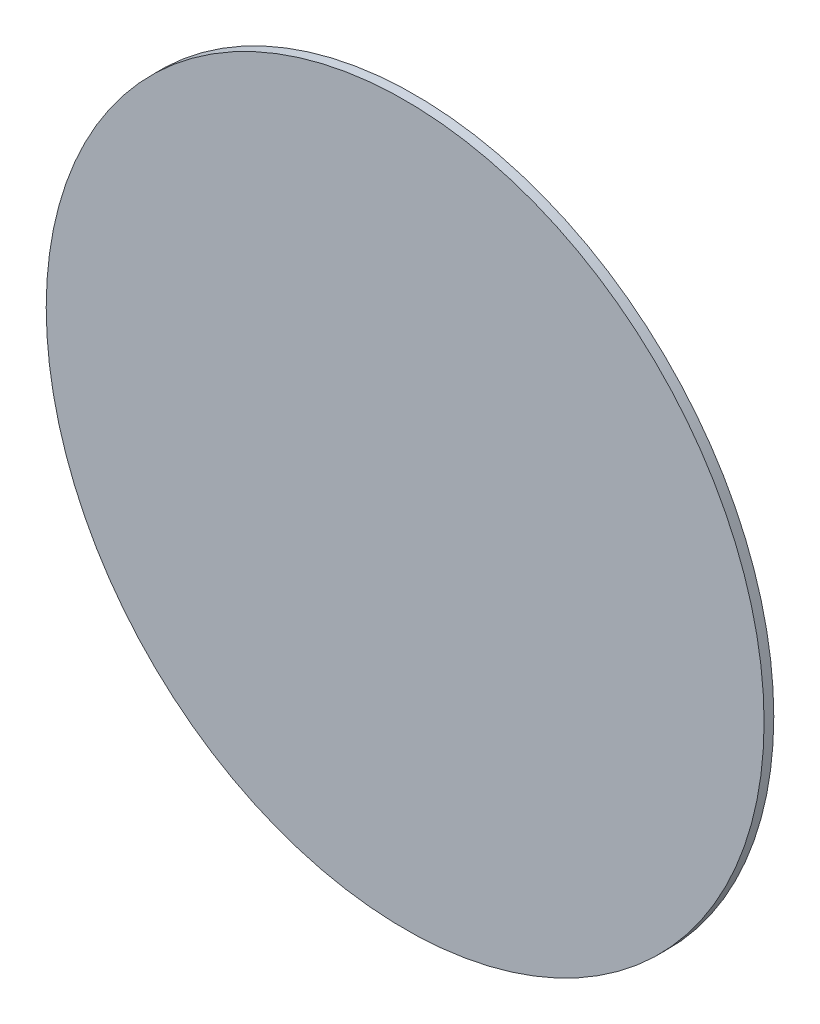
ISO-10303-21;
HEADER;
FILE_DESCRIPTION(('STEP AP214'),'2;1');
FILE_NAME('part.step','',(''),(''),'','','');
FILE_SCHEMA(('AUTOMOTIVE_DESIGN { 1 0 10303 214 1 1 1 1 }'));
ENDSEC;
DATA;
#1=APPLICATION_CONTEXT('core data for automotive mechanical design processes');
#2=APPLICATION_PROTOCOL_DEFINITION('international standard','automotive_design',2000,#1);
#3=PRODUCT_CONTEXT('',#1,'mechanical');
#4=PRODUCT('Part','Part','',(#3));
#5=PRODUCT_RELATED_PRODUCT_CATEGORY('part','',(#4));
#6=PRODUCT_DEFINITION_FORMATION('','',#4);
#7=PRODUCT_DEFINITION_CONTEXT('part definition',#1,'design');
#8=PRODUCT_DEFINITION('design','',#6,#7);
#9=PRODUCT_DEFINITION_SHAPE('','',#8);
#10=(LENGTH_UNIT() NAMED_UNIT(*) SI_UNIT(.MILLI.,.METRE.));
#11=(NAMED_UNIT(*) PLANE_ANGLE_UNIT() SI_UNIT($,.RADIAN.));
#12=(NAMED_UNIT(*) SI_UNIT($,.STERADIAN.) SOLID_ANGLE_UNIT());
#13=UNCERTAINTY_MEASURE_WITH_UNIT(LENGTH_MEASURE(1.E-05),#10,'distance_accuracy_value','');
#14=(GEOMETRIC_REPRESENTATION_CONTEXT(3) GLOBAL_UNCERTAINTY_ASSIGNED_CONTEXT((#13)) GLOBAL_UNIT_ASSIGNED_CONTEXT((#10,
#11,#12)) REPRESENTATION_CONTEXT('',''));
#15=CARTESIAN_POINT('',(0.,0.,0.));
#16=DIRECTION('',(0.,0.,1.));
#17=DIRECTION('',(1.,0.,0.));
#18=AXIS2_PLACEMENT_3D('',#15,#16,#17);
#19=CARTESIAN_POINT('',(0.,0.,-2.));
#20=DIRECTION('',(0.,0.,1.));
#21=DIRECTION('',(1.,0.,0.));
#22=AXIS2_PLACEMENT_3D('',#19,#20,#21);
#23=CYLINDRICAL_SURFACE('',#22,74.);
#24=CARTESIAN_POINT('',(0.,0.,-2.));
#25=DIRECTION('',(0.,0.,1.));
#26=DIRECTION('',(1.,0.,0.));
#27=AXIS2_PLACEMENT_3D('',#24,#25,#26);
#28=CIRCLE('',#27,74.);
#29=CARTESIAN_POINT('',(74.,0.,-2.));
#30=VERTEX_POINT('',#29);
#31=EDGE_CURVE('E10',#30,#30,#28,.T.);
#32=ORIENTED_EDGE('',*,*,#31,.T.);
#33=EDGE_LOOP('',(#32));
#34=FACE_BOUND('',#33,.T.);
#35=CARTESIAN_POINT('',(0.,0.,0.));
#36=DIRECTION('',(0.,0.,1.));
#37=DIRECTION('',(1.,0.,0.));
#38=AXIS2_PLACEMENT_3D('',#35,#36,#37);
#39=CIRCLE('',#38,74.);
#40=CARTESIAN_POINT('',(74.,0.,0.));
#41=VERTEX_POINT('',#40);
#42=EDGE_CURVE('E37',#41,#41,#39,.T.);
#43=ORIENTED_EDGE('',*,*,#42,.F.);
#44=EDGE_LOOP('',(#43));
#45=FACE_BOUND('',#44,.T.);
#46=ADVANCED_FACE('F34',(#34,#45),#23,.T.);
#47=CARTESIAN_POINT('',(0.,0.,-2.));
#48=DIRECTION('',(0.,0.,1.));
#49=DIRECTION('',(1.,0.,0.));
#50=AXIS2_PLACEMENT_3D('',#47,#48,#49);
#51=PLANE('',#50);
#52=ORIENTED_EDGE('',*,*,#31,.F.);
#53=EDGE_LOOP('',(#52));
#54=FACE_BOUND('',#53,.T.);
#55=ADVANCED_FACE('F49',(#54),#51,.F.);
#56=CARTESIAN_POINT('',(0.,0.,0.));
#57=DIRECTION('',(0.,0.,1.));
#58=DIRECTION('',(1.,0.,0.));
#59=AXIS2_PLACEMENT_3D('',#56,#57,#58);
#60=PLANE('',#59);
#61=ORIENTED_EDGE('',*,*,#42,.T.);
#62=EDGE_LOOP('',(#61));
#63=FACE_BOUND('',#62,.T.);
#64=ADVANCED_FACE('F46',(#63),#60,.T.);
#65=CLOSED_SHELL('',(#46,#55,#64));
#66=MANIFOLD_SOLID_BREP('B2',#65);
#67=ADVANCED_BREP_SHAPE_REPRESENTATION('',(#18,#66),#14);
#68=SHAPE_DEFINITION_REPRESENTATION(#9,#67);
ENDSEC;
END-ISO-10303-21;
